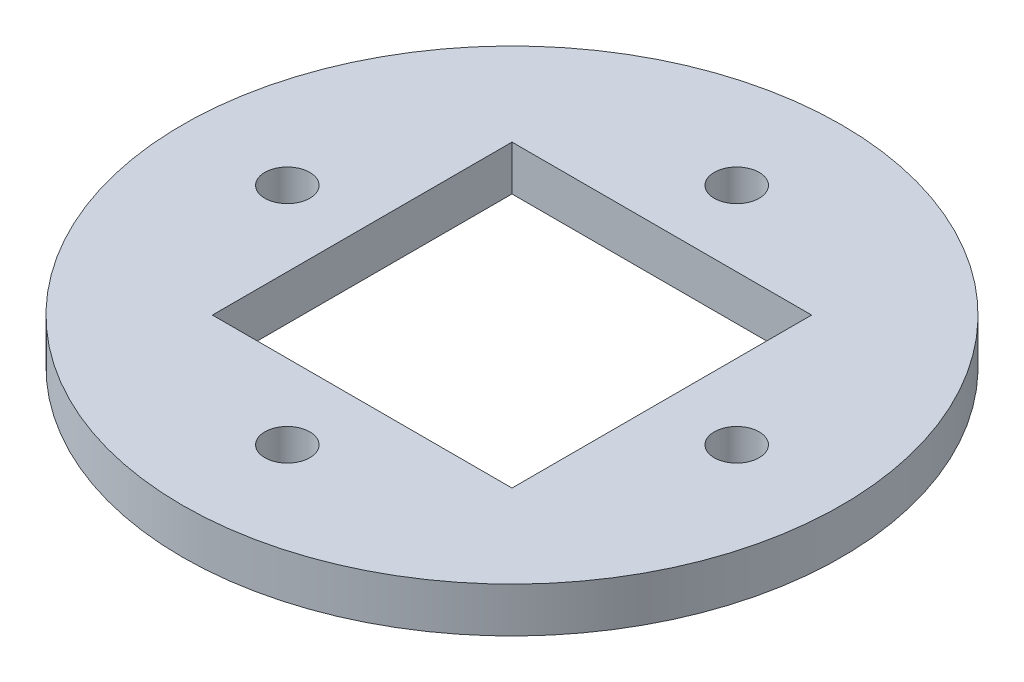
ISO-10303-21;
HEADER;
FILE_DESCRIPTION(('STEP AP214'),'2;1');
FILE_NAME('part.step','',(''),(''),'','','');
FILE_SCHEMA(('AUTOMOTIVE_DESIGN { 1 0 10303 214 1 1 1 1 }'));
ENDSEC;
DATA;
#1=APPLICATION_CONTEXT('core data for automotive mechanical design processes');
#2=APPLICATION_PROTOCOL_DEFINITION('international standard','automotive_design',2000,#1);
#3=PRODUCT_CONTEXT('',#1,'mechanical');
#4=PRODUCT('Part','Part','',(#3));
#5=PRODUCT_RELATED_PRODUCT_CATEGORY('part','',(#4));
#6=PRODUCT_DEFINITION_FORMATION('','',#4);
#7=PRODUCT_DEFINITION_CONTEXT('part definition',#1,'design');
#8=PRODUCT_DEFINITION('design','',#6,#7);
#9=PRODUCT_DEFINITION_SHAPE('','',#8);
#10=(LENGTH_UNIT() NAMED_UNIT(*) SI_UNIT(.MILLI.,.METRE.));
#11=(NAMED_UNIT(*) PLANE_ANGLE_UNIT() SI_UNIT($,.RADIAN.));
#12=(NAMED_UNIT(*) SI_UNIT($,.STERADIAN.) SOLID_ANGLE_UNIT());
#13=UNCERTAINTY_MEASURE_WITH_UNIT(LENGTH_MEASURE(1.E-05),#10,'distance_accuracy_value','');
#14=(GEOMETRIC_REPRESENTATION_CONTEXT(3) GLOBAL_UNCERTAINTY_ASSIGNED_CONTEXT((#13)) GLOBAL_UNIT_ASSIGNED_CONTEXT((#10,
#11,#12)) REPRESENTATION_CONTEXT('',''));
#15=CARTESIAN_POINT('',(0.,0.,0.));
#16=DIRECTION('',(0.,0.,1.));
#17=DIRECTION('',(1.,0.,0.));
#18=AXIS2_PLACEMENT_3D('',#15,#16,#17);
#19=CARTESIAN_POINT('',(0.,3.,0.));
#20=DIRECTION('',(0.,1.,0.));
#21=DIRECTION('',(0.,0.,1.));
#22=AXIS2_PLACEMENT_3D('',#19,#20,#21);
#23=PLANE('',#22);
#24=CARTESIAN_POINT('',(15.,3.,1.04744440165294E-13));
#25=DIRECTION('',(0.,1.,0.));
#26=DIRECTION('',(0.,0.,1.));
#27=AXIS2_PLACEMENT_3D('',#24,#25,#26);
#28=CIRCLE('',#27,1.5);
#29=CARTESIAN_POINT('',(15.,3.,1.50000000000011));
#30=VERTEX_POINT('',#29);
#31=EDGE_CURVE('E148',#30,#30,#28,.T.);
#32=ORIENTED_EDGE('',*,*,#31,.F.);
#33=EDGE_LOOP('',(#32));
#34=FACE_BOUND('',#33,.T.);
#35=DIRECTION('',(-1.,0.,0.));
#36=VECTOR('',#35,1.);
#37=CARTESIAN_POINT('',(-10.,3.,-10.));
#38=LINE('',#37,#36);
#39=CARTESIAN_POINT('',(10.,3.,-10.));
#40=VERTEX_POINT('',#39);
#41=CARTESIAN_POINT('',(-10.,3.,-10.));
#42=VERTEX_POINT('',#41);
#43=EDGE_CURVE('E90',#40,#42,#38,.T.);
#44=ORIENTED_EDGE('',*,*,#43,.F.);
#45=DIRECTION('',(0.,0.,-1.));
#46=VECTOR('',#45,1.);
#47=CARTESIAN_POINT('',(10.,3.,10.));
#48=LINE('',#47,#46);
#49=CARTESIAN_POINT('',(10.,3.,10.));
#50=VERTEX_POINT('',#49);
#51=EDGE_CURVE('E82',#50,#40,#48,.T.);
#52=ORIENTED_EDGE('',*,*,#51,.F.);
#53=DIRECTION('',(1.,0.,0.));
#54=VECTOR('',#53,1.);
#55=CARTESIAN_POINT('',(-10.,3.,10.));
#56=LINE('',#55,#54);
#57=CARTESIAN_POINT('',(-10.,3.,10.));
#58=VERTEX_POINT('',#57);
#59=EDGE_CURVE('E105',#58,#50,#56,.T.);
#60=ORIENTED_EDGE('',*,*,#59,.F.);
#61=DIRECTION('',(0.,0.,1.));
#62=VECTOR('',#61,1.);
#63=CARTESIAN_POINT('',(-10.,3.,10.));
#64=LINE('',#63,#62);
#65=EDGE_CURVE('E103',#42,#58,#64,.T.);
#66=ORIENTED_EDGE('',*,*,#65,.F.);
#67=EDGE_LOOP('',(#44,#52,#60,#66));
#68=FACE_BOUND('',#67,.T.);
#69=CARTESIAN_POINT('',(-15.,3.,0.));
#70=DIRECTION('',(0.,1.,0.));
#71=DIRECTION('',(0.,0.,1.));
#72=AXIS2_PLACEMENT_3D('',#69,#70,#71);
#73=CIRCLE('',#72,1.5);
#74=CARTESIAN_POINT('',(-15.,3.,1.5));
#75=VERTEX_POINT('',#74);
#76=EDGE_CURVE('E121',#75,#75,#73,.T.);
#77=ORIENTED_EDGE('',*,*,#76,.F.);
#78=EDGE_LOOP('',(#77));
#79=FACE_BOUND('',#78,.T.);
#80=CARTESIAN_POINT('',(0.,3.,0.));
#81=DIRECTION('',(0.,1.,0.));
#82=DIRECTION('',(0.,0.,1.));
#83=AXIS2_PLACEMENT_3D('',#80,#81,#82);
#84=CIRCLE('',#83,22.);
#85=CARTESIAN_POINT('',(0.,3.,22.));
#86=VERTEX_POINT('',#85);
#87=EDGE_CURVE('E11',#86,#86,#84,.T.);
#88=ORIENTED_EDGE('',*,*,#87,.T.);
#89=EDGE_LOOP('',(#88));
#90=FACE_BOUND('',#89,.T.);
#91=CARTESIAN_POINT('',(0.,3.,-15.));
#92=DIRECTION('',(0.,1.,0.));
#93=DIRECTION('',(0.,0.,1.));
#94=AXIS2_PLACEMENT_3D('',#91,#92,#93);
#95=CIRCLE('',#94,1.5);
#96=CARTESIAN_POINT('',(0.,3.,-13.5));
#97=VERTEX_POINT('',#96);
#98=EDGE_CURVE('E111',#97,#97,#95,.T.);
#99=ORIENTED_EDGE('',*,*,#98,.F.);
#100=EDGE_LOOP('',(#99));
#101=FACE_BOUND('',#100,.T.);
#102=CARTESIAN_POINT('',(-1.57116660247941E-13,3.,15.));
#103=DIRECTION('',(0.,1.,0.));
#104=DIRECTION('',(0.,0.,1.));
#105=AXIS2_PLACEMENT_3D('',#102,#103,#104);
#106=CIRCLE('',#105,1.5);
#107=CARTESIAN_POINT('',(-1.57116660247941E-13,3.,16.5));
#108=VERTEX_POINT('',#107);
#109=EDGE_CURVE('E155',#108,#108,#106,.T.);
#110=ORIENTED_EDGE('',*,*,#109,.F.);
#111=EDGE_LOOP('',(#110));
#112=FACE_BOUND('',#111,.T.);
#113=ADVANCED_FACE('F41',(#34,#68,#79,#90,#101,#112),#23,.T.);
#114=CARTESIAN_POINT('',(0.,0.,0.));
#115=DIRECTION('',(0.,1.,0.));
#116=DIRECTION('',(0.,0.,1.));
#117=AXIS2_PLACEMENT_3D('',#114,#115,#116);
#118=PLANE('',#117);
#119=CARTESIAN_POINT('',(-15.,0.,0.));
#120=DIRECTION('',(0.,1.,0.));
#121=DIRECTION('',(0.,0.,1.));
#122=AXIS2_PLACEMENT_3D('',#119,#120,#121);
#123=CIRCLE('',#122,1.5);
#124=CARTESIAN_POINT('',(-15.,0.,1.5));
#125=VERTEX_POINT('',#124);
#126=EDGE_CURVE('E98',#125,#125,#123,.T.);
#127=ORIENTED_EDGE('',*,*,#126,.T.);
#128=EDGE_LOOP('',(#127));
#129=FACE_BOUND('',#128,.T.);
#130=CARTESIAN_POINT('',(0.,0.,0.));
#131=DIRECTION('',(0.,1.,0.));
#132=DIRECTION('',(0.,0.,1.));
#133=AXIS2_PLACEMENT_3D('',#130,#131,#132);
#134=CIRCLE('',#133,22.);
#135=CARTESIAN_POINT('',(0.,0.,22.));
#136=VERTEX_POINT('',#135);
#137=EDGE_CURVE('E45',#136,#136,#134,.T.);
#138=ORIENTED_EDGE('',*,*,#137,.F.);
#139=EDGE_LOOP('',(#138));
#140=FACE_BOUND('',#139,.T.);
#141=DIRECTION('',(0.,0.,-1.));
#142=VECTOR('',#141,1.);
#143=CARTESIAN_POINT('',(10.,0.,10.));
#144=LINE('',#143,#142);
#145=CARTESIAN_POINT('',(10.,0.,10.));
#146=VERTEX_POINT('',#145);
#147=CARTESIAN_POINT('',(10.,0.,-10.));
#148=VERTEX_POINT('',#147);
#149=EDGE_CURVE('E64',#146,#148,#144,.T.);
#150=ORIENTED_EDGE('',*,*,#149,.T.);
#151=DIRECTION('',(-1.,0.,0.));
#152=VECTOR('',#151,1.);
#153=CARTESIAN_POINT('',(-10.,0.,-10.));
#154=LINE('',#153,#152);
#155=CARTESIAN_POINT('',(-10.,0.,-10.));
#156=VERTEX_POINT('',#155);
#157=EDGE_CURVE('E97',#148,#156,#154,.T.);
#158=ORIENTED_EDGE('',*,*,#157,.T.);
#159=DIRECTION('',(0.,0.,1.));
#160=VECTOR('',#159,1.);
#161=CARTESIAN_POINT('',(-10.,0.,10.));
#162=LINE('',#161,#160);
#163=CARTESIAN_POINT('',(-10.,0.,10.));
#164=VERTEX_POINT('',#163);
#165=EDGE_CURVE('E113',#156,#164,#162,.T.);
#166=ORIENTED_EDGE('',*,*,#165,.T.);
#167=DIRECTION('',(1.,0.,0.));
#168=VECTOR('',#167,1.);
#169=CARTESIAN_POINT('',(-10.,0.,10.));
#170=LINE('',#169,#168);
#171=EDGE_CURVE('E91',#164,#146,#170,.T.);
#172=ORIENTED_EDGE('',*,*,#171,.T.);
#173=EDGE_LOOP('',(#150,#158,#166,#172));
#174=FACE_BOUND('',#173,.T.);
#175=CARTESIAN_POINT('',(0.,0.,-15.));
#176=DIRECTION('',(0.,1.,0.));
#177=DIRECTION('',(0.,0.,1.));
#178=AXIS2_PLACEMENT_3D('',#175,#176,#177);
#179=CIRCLE('',#178,1.5);
#180=CARTESIAN_POINT('',(0.,0.,-13.5));
#181=VERTEX_POINT('',#180);
#182=EDGE_CURVE('E150',#181,#181,#179,.T.);
#183=ORIENTED_EDGE('',*,*,#182,.T.);
#184=EDGE_LOOP('',(#183));
#185=FACE_BOUND('',#184,.T.);
#186=CARTESIAN_POINT('',(15.,0.,1.04744440165294E-13));
#187=DIRECTION('',(0.,1.,0.));
#188=DIRECTION('',(0.,0.,1.));
#189=AXIS2_PLACEMENT_3D('',#186,#187,#188);
#190=CIRCLE('',#189,1.5);
#191=CARTESIAN_POINT('',(15.,0.,1.50000000000011));
#192=VERTEX_POINT('',#191);
#193=EDGE_CURVE('E151',#192,#192,#190,.T.);
#194=ORIENTED_EDGE('',*,*,#193,.T.);
#195=EDGE_LOOP('',(#194));
#196=FACE_BOUND('',#195,.T.);
#197=CARTESIAN_POINT('',(-1.57116660247941E-13,0.,15.));
#198=DIRECTION('',(0.,1.,0.));
#199=DIRECTION('',(0.,0.,1.));
#200=AXIS2_PLACEMENT_3D('',#197,#198,#199);
#201=CIRCLE('',#200,1.5);
#202=CARTESIAN_POINT('',(-1.57116660247941E-13,0.,16.5));
#203=VERTEX_POINT('',#202);
#204=EDGE_CURVE('E158',#203,#203,#201,.T.);
#205=ORIENTED_EDGE('',*,*,#204,.T.);
#206=EDGE_LOOP('',(#205));
#207=FACE_BOUND('',#206,.T.);
#208=ADVANCED_FACE('F127',(#129,#140,#174,#185,#196,#207),#118,.F.);
#209=CARTESIAN_POINT('',(0.,3.,0.));
#210=DIRECTION('',(0.,-1.,0.));
#211=DIRECTION('',(0.,0.,-1.));
#212=AXIS2_PLACEMENT_3D('',#209,#210,#211);
#213=CYLINDRICAL_SURFACE('',#212,22.);
#214=ORIENTED_EDGE('',*,*,#87,.F.);
#215=EDGE_LOOP('',(#214));
#216=FACE_BOUND('',#215,.T.);
#217=ORIENTED_EDGE('',*,*,#137,.T.);
#218=EDGE_LOOP('',(#217));
#219=FACE_BOUND('',#218,.T.);
#220=ADVANCED_FACE('F43',(#216,#219),#213,.T.);
#221=CARTESIAN_POINT('',(-15.,3.,0.));
#222=DIRECTION('',(0.,-1.,0.));
#223=DIRECTION('',(0.,0.,-1.));
#224=AXIS2_PLACEMENT_3D('',#221,#222,#223);
#225=CYLINDRICAL_SURFACE('',#224,1.5);
#226=ORIENTED_EDGE('',*,*,#76,.T.);
#227=EDGE_LOOP('',(#226));
#228=FACE_BOUND('',#227,.T.);
#229=ORIENTED_EDGE('',*,*,#126,.F.);
#230=EDGE_LOOP('',(#229));
#231=FACE_BOUND('',#230,.T.);
#232=ADVANCED_FACE('F130',(#228,#231),#225,.F.);
#233=CARTESIAN_POINT('',(10.,3.,10.));
#234=DIRECTION('',(-1.,0.,0.));
#235=DIRECTION('',(0.,0.,1.));
#236=AXIS2_PLACEMENT_3D('',#233,#234,#235);
#237=PLANE('',#236);
#238=ORIENTED_EDGE('',*,*,#149,.F.);
#239=DIRECTION('',(0.,-1.,0.));
#240=VECTOR('',#239,1.);
#241=CARTESIAN_POINT('',(10.,3.,10.));
#242=LINE('',#241,#240);
#243=EDGE_CURVE('E86',#50,#146,#242,.T.);
#244=ORIENTED_EDGE('',*,*,#243,.F.);
#245=ORIENTED_EDGE('',*,*,#51,.T.);
#246=DIRECTION('',(0.,-1.,0.));
#247=VECTOR('',#246,1.);
#248=CARTESIAN_POINT('',(10.,3.,-10.));
#249=LINE('',#248,#247);
#250=EDGE_CURVE('E85',#40,#148,#249,.T.);
#251=ORIENTED_EDGE('',*,*,#250,.T.);
#252=EDGE_LOOP('',(#238,#244,#245,#251));
#253=FACE_BOUND('',#252,.T.);
#254=ADVANCED_FACE('F84',(#253),#237,.T.);
#255=CARTESIAN_POINT('',(-10.,3.,-10.));
#256=DIRECTION('',(0.,0.,1.));
#257=DIRECTION('',(1.,0.,0.));
#258=AXIS2_PLACEMENT_3D('',#255,#256,#257);
#259=PLANE('',#258);
#260=ORIENTED_EDGE('',*,*,#157,.F.);
#261=ORIENTED_EDGE('',*,*,#250,.F.);
#262=ORIENTED_EDGE('',*,*,#43,.T.);
#263=DIRECTION('',(0.,-1.,0.));
#264=VECTOR('',#263,1.);
#265=CARTESIAN_POINT('',(-10.,3.,-10.));
#266=LINE('',#265,#264);
#267=EDGE_CURVE('E99',#42,#156,#266,.T.);
#268=ORIENTED_EDGE('',*,*,#267,.T.);
#269=EDGE_LOOP('',(#260,#261,#262,#268));
#270=FACE_BOUND('',#269,.T.);
#271=ADVANCED_FACE('F94',(#270),#259,.T.);
#272=CARTESIAN_POINT('',(-10.,3.,10.));
#273=DIRECTION('',(1.,0.,0.));
#274=DIRECTION('',(0.,0.,-1.));
#275=AXIS2_PLACEMENT_3D('',#272,#273,#274);
#276=PLANE('',#275);
#277=ORIENTED_EDGE('',*,*,#165,.F.);
#278=ORIENTED_EDGE('',*,*,#267,.F.);
#279=ORIENTED_EDGE('',*,*,#65,.T.);
#280=DIRECTION('',(0.,-1.,0.));
#281=VECTOR('',#280,1.);
#282=CARTESIAN_POINT('',(-10.,3.,10.));
#283=LINE('',#282,#281);
#284=EDGE_CURVE('E56',#58,#164,#283,.T.);
#285=ORIENTED_EDGE('',*,*,#284,.T.);
#286=EDGE_LOOP('',(#277,#278,#279,#285));
#287=FACE_BOUND('',#286,.T.);
#288=ADVANCED_FACE('F189',(#287),#276,.T.);
#289=CARTESIAN_POINT('',(-10.,3.,10.));
#290=DIRECTION('',(0.,0.,-1.));
#291=DIRECTION('',(-1.,0.,0.));
#292=AXIS2_PLACEMENT_3D('',#289,#290,#291);
#293=PLANE('',#292);
#294=ORIENTED_EDGE('',*,*,#171,.F.);
#295=ORIENTED_EDGE('',*,*,#284,.F.);
#296=ORIENTED_EDGE('',*,*,#59,.T.);
#297=ORIENTED_EDGE('',*,*,#243,.T.);
#298=EDGE_LOOP('',(#294,#295,#296,#297));
#299=FACE_BOUND('',#298,.T.);
#300=ADVANCED_FACE('F186',(#299),#293,.T.);
#301=CARTESIAN_POINT('',(0.,3.,-15.));
#302=DIRECTION('',(0.,-1.,0.));
#303=DIRECTION('',(0.,0.,-1.));
#304=AXIS2_PLACEMENT_3D('',#301,#302,#303);
#305=CYLINDRICAL_SURFACE('',#304,1.5);
#306=ORIENTED_EDGE('',*,*,#98,.T.);
#307=EDGE_LOOP('',(#306));
#308=FACE_BOUND('',#307,.T.);
#309=ORIENTED_EDGE('',*,*,#182,.F.);
#310=EDGE_LOOP('',(#309));
#311=FACE_BOUND('',#310,.T.);
#312=ADVANCED_FACE('F164',(#308,#311),#305,.F.);
#313=CARTESIAN_POINT('',(15.,3.,1.04744440165294E-13));
#314=DIRECTION('',(0.,-1.,0.));
#315=DIRECTION('',(0.,0.,-1.));
#316=AXIS2_PLACEMENT_3D('',#313,#314,#315);
#317=CYLINDRICAL_SURFACE('',#316,1.5);
#318=ORIENTED_EDGE('',*,*,#31,.T.);
#319=EDGE_LOOP('',(#318));
#320=FACE_BOUND('',#319,.T.);
#321=ORIENTED_EDGE('',*,*,#193,.F.);
#322=EDGE_LOOP('',(#321));
#323=FACE_BOUND('',#322,.T.);
#324=ADVANCED_FACE('F177',(#320,#323),#317,.F.);
#325=CARTESIAN_POINT('',(-1.57116660247941E-13,3.,15.));
#326=DIRECTION('',(0.,-1.,0.));
#327=DIRECTION('',(0.,0.,-1.));
#328=AXIS2_PLACEMENT_3D('',#325,#326,#327);
#329=CYLINDRICAL_SURFACE('',#328,1.5);
#330=ORIENTED_EDGE('',*,*,#109,.T.);
#331=EDGE_LOOP('',(#330));
#332=FACE_BOUND('',#331,.T.);
#333=ORIENTED_EDGE('',*,*,#204,.F.);
#334=EDGE_LOOP('',(#333));
#335=FACE_BOUND('',#334,.T.);
#336=ADVANCED_FACE('F175',(#332,#335),#329,.F.);
#337=CLOSED_SHELL('',(#113,#208,#220,#232,#254,#271,#288,#300,#312,#324,#336));
#338=MANIFOLD_SOLID_BREP('B2',#337);
#339=ADVANCED_BREP_SHAPE_REPRESENTATION('',(#18,#338),#14);
#340=SHAPE_DEFINITION_REPRESENTATION(#9,#339);
ENDSEC;
END-ISO-10303-21;
